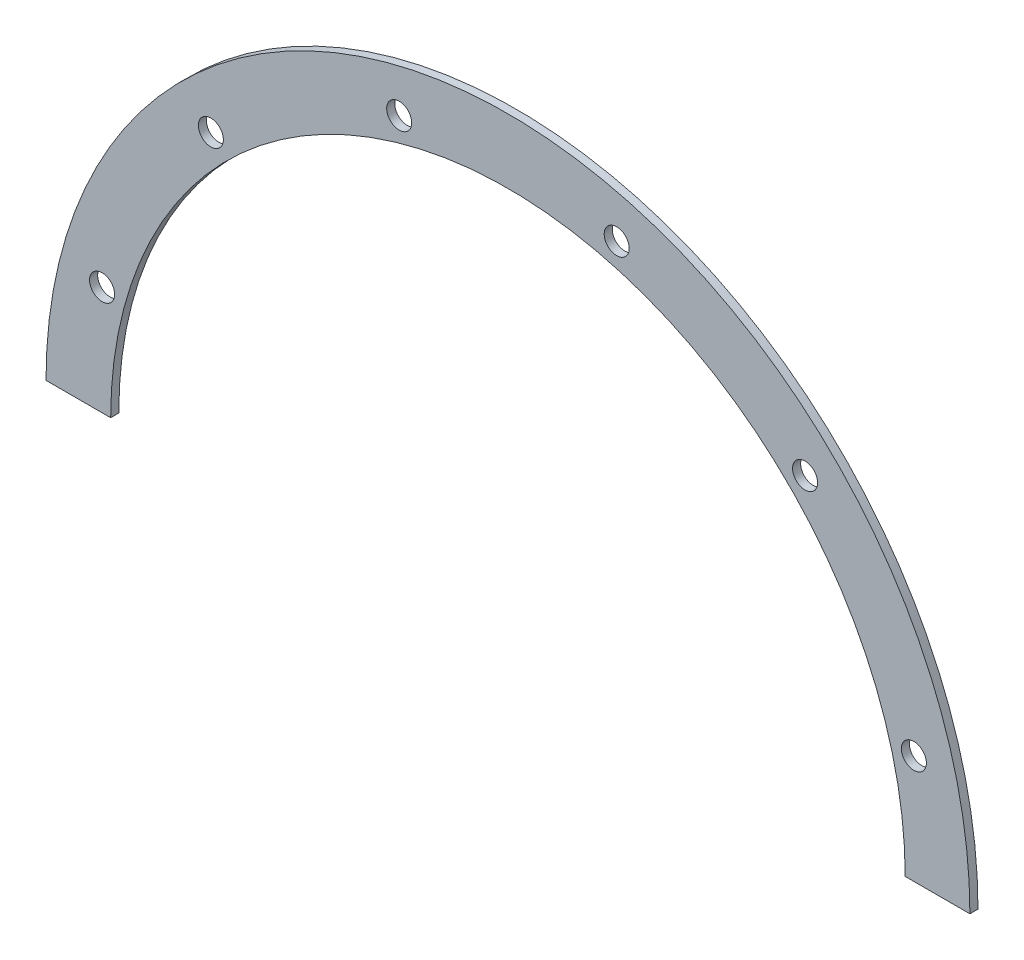
ISO-10303-21;
HEADER;
FILE_DESCRIPTION(('STEP AP214'),'2;1');
FILE_NAME('part.step','',(''),(''),'','','');
FILE_SCHEMA(('AUTOMOTIVE_DESIGN { 1 0 10303 214 1 1 1 1 }'));
ENDSEC;
DATA;
#1=APPLICATION_CONTEXT('core data for automotive mechanical design processes');
#2=APPLICATION_PROTOCOL_DEFINITION('international standard','automotive_design',2000,#1);
#3=PRODUCT_CONTEXT('',#1,'mechanical');
#4=PRODUCT('Part','Part','',(#3));
#5=PRODUCT_RELATED_PRODUCT_CATEGORY('part','',(#4));
#6=PRODUCT_DEFINITION_FORMATION('','',#4);
#7=PRODUCT_DEFINITION_CONTEXT('part definition',#1,'design');
#8=PRODUCT_DEFINITION('design','',#6,#7);
#9=PRODUCT_DEFINITION_SHAPE('','',#8);
#10=(LENGTH_UNIT() NAMED_UNIT(*) SI_UNIT(.MILLI.,.METRE.));
#11=(NAMED_UNIT(*) PLANE_ANGLE_UNIT() SI_UNIT($,.RADIAN.));
#12=(NAMED_UNIT(*) SI_UNIT($,.STERADIAN.) SOLID_ANGLE_UNIT());
#13=UNCERTAINTY_MEASURE_WITH_UNIT(LENGTH_MEASURE(1.E-05),#10,'distance_accuracy_value','');
#14=(GEOMETRIC_REPRESENTATION_CONTEXT(3) GLOBAL_UNCERTAINTY_ASSIGNED_CONTEXT((#13)) GLOBAL_UNIT_ASSIGNED_CONTEXT((#10,
#11,#12)) REPRESENTATION_CONTEXT('',''));
#15=CARTESIAN_POINT('',(0.,0.,0.));
#16=DIRECTION('',(0.,0.,1.));
#17=DIRECTION('',(1.,0.,0.));
#18=AXIS2_PLACEMENT_3D('',#15,#16,#17);
#19=CARTESIAN_POINT('',(0.,0.,1.5875));
#20=DIRECTION('',(0.,0.,-1.));
#21=DIRECTION('',(-1.,0.,0.));
#22=AXIS2_PLACEMENT_3D('',#19,#20,#21);
#23=PLANE('',#22);
#24=CARTESIAN_POINT('',(-58.3363094478905,58.3363094478899,1.5875));
#25=DIRECTION('',(0.,0.,1.));
#26=DIRECTION('',(1.,0.,0.));
#27=AXIS2_PLACEMENT_3D('',#24,#25,#26);
#28=CIRCLE('',#27,2.45744999999999);
#29=CARTESIAN_POINT('',(-55.8788594478905,58.3363094478899,1.5875));
#30=VERTEX_POINT('',#29);
#31=EDGE_CURVE('E140',#30,#30,#28,.T.);
#32=ORIENTED_EDGE('',*,*,#31,.F.);
#33=EDGE_LOOP('',(#32));
#34=FACE_BOUND('',#33,.T.);
#35=CARTESIAN_POINT('',(21.3525712209577,79.6888806688482,1.5875));
#36=DIRECTION('',(0.,0.,1.));
#37=DIRECTION('',(1.,0.,0.));
#38=AXIS2_PLACEMENT_3D('',#35,#36,#37);
#39=CIRCLE('',#38,2.45744999999999);
#40=CARTESIAN_POINT('',(23.8100212209577,79.6888806688482,1.5875));
#41=VERTEX_POINT('',#40);
#42=EDGE_CURVE('E128',#41,#41,#39,.T.);
#43=ORIENTED_EDGE('',*,*,#42,.F.);
#44=EDGE_LOOP('',(#43));
#45=FACE_BOUND('',#44,.T.);
#46=CARTESIAN_POINT('',(58.3363094478901,58.3363094478903,1.5875));
#47=DIRECTION('',(0.,0.,1.));
#48=DIRECTION('',(1.,0.,0.));
#49=AXIS2_PLACEMENT_3D('',#46,#47,#48);
#50=CIRCLE('',#49,2.45744999999999);
#51=CARTESIAN_POINT('',(60.79375944789,58.3363094478903,1.5875));
#52=VERTEX_POINT('',#51);
#53=EDGE_CURVE('E122',#52,#52,#50,.T.);
#54=ORIENTED_EDGE('',*,*,#53,.F.);
#55=EDGE_LOOP('',(#54));
#56=FACE_BOUND('',#55,.T.);
#57=CARTESIAN_POINT('',(79.6888806688481,21.352571220958,1.5875));
#58=DIRECTION('',(0.,0.,1.));
#59=DIRECTION('',(1.,0.,0.));
#60=AXIS2_PLACEMENT_3D('',#57,#58,#59);
#61=CIRCLE('',#60,2.45744999999999);
#62=CARTESIAN_POINT('',(82.1463306688481,21.352571220958,1.5875));
#63=VERTEX_POINT('',#62);
#64=EDGE_CURVE('E116',#63,#63,#61,.T.);
#65=ORIENTED_EDGE('',*,*,#64,.F.);
#66=EDGE_LOOP('',(#65));
#67=FACE_BOUND('',#66,.T.);
#68=CARTESIAN_POINT('',(0.,0.,1.5875));
#69=DIRECTION('',(0.,0.,-1.));
#70=DIRECTION('',(-1.,0.,0.));
#71=AXIS2_PLACEMENT_3D('',#68,#69,#70);
#72=CIRCLE('',#71,78.);
#73=CARTESIAN_POINT('',(-78.,0.,1.5875));
#74=VERTEX_POINT('',#73);
#75=CARTESIAN_POINT('',(78.,0.,1.5875));
#76=VERTEX_POINT('',#75);
#77=EDGE_CURVE('E87',#74,#76,#72,.T.);
#78=ORIENTED_EDGE('',*,*,#77,.T.);
#79=DIRECTION('',(1.,0.,0.));
#80=VECTOR('',#79,1.);
#81=CARTESIAN_POINT('',(78.,0.,1.5875));
#82=LINE('',#81,#80);
#83=CARTESIAN_POINT('',(90.7,0.,1.5875));
#84=VERTEX_POINT('',#83);
#85=EDGE_CURVE('E82',#76,#84,#82,.T.);
#86=ORIENTED_EDGE('',*,*,#85,.T.);
#87=CARTESIAN_POINT('',(0.,0.,1.5875));
#88=DIRECTION('',(0.,0.,1.));
#89=DIRECTION('',(1.,0.,0.));
#90=AXIS2_PLACEMENT_3D('',#87,#88,#89);
#91=CIRCLE('',#90,90.7);
#92=CARTESIAN_POINT('',(-90.7,0.,1.5875));
#93=VERTEX_POINT('',#92);
#94=EDGE_CURVE('E85',#84,#93,#91,.T.);
#95=ORIENTED_EDGE('',*,*,#94,.T.);
#96=DIRECTION('',(1.,0.,0.));
#97=VECTOR('',#96,1.);
#98=CARTESIAN_POINT('',(-90.7,0.,1.5875));
#99=LINE('',#98,#97);
#100=EDGE_CURVE('E52',#93,#74,#99,.T.);
#101=ORIENTED_EDGE('',*,*,#100,.T.);
#102=EDGE_LOOP('',(#78,#86,#95,#101));
#103=FACE_BOUND('',#102,.T.);
#104=CARTESIAN_POINT('',(-21.3525712209583,79.6888806688481,1.5875));
#105=DIRECTION('',(0.,0.,1.));
#106=DIRECTION('',(1.,0.,0.));
#107=AXIS2_PLACEMENT_3D('',#104,#105,#106);
#108=CIRCLE('',#107,2.45744999999999);
#109=CARTESIAN_POINT('',(-18.8951212209583,79.6888806688481,1.5875));
#110=VERTEX_POINT('',#109);
#111=EDGE_CURVE('E134',#110,#110,#108,.T.);
#112=ORIENTED_EDGE('',*,*,#111,.F.);
#113=EDGE_LOOP('',(#112));
#114=FACE_BOUND('',#113,.T.);
#115=CARTESIAN_POINT('',(-79.6888806688483,21.3525712209574,1.5875));
#116=DIRECTION('',(0.,0.,1.));
#117=DIRECTION('',(1.,0.,0.));
#118=AXIS2_PLACEMENT_3D('',#115,#116,#117);
#119=CIRCLE('',#118,2.45744999999999);
#120=CARTESIAN_POINT('',(-77.2314306688483,21.3525712209574,1.5875));
#121=VERTEX_POINT('',#120);
#122=EDGE_CURVE('E146',#121,#121,#119,.T.);
#123=ORIENTED_EDGE('',*,*,#122,.F.);
#124=EDGE_LOOP('',(#123));
#125=FACE_BOUND('',#124,.T.);
#126=ADVANCED_FACE('F35',(#34,#45,#56,#67,#103,#114,#125),#23,.F.);
#127=CARTESIAN_POINT('',(0.,0.,0.));
#128=DIRECTION('',(0.,0.,-1.));
#129=DIRECTION('',(-1.,0.,0.));
#130=AXIS2_PLACEMENT_3D('',#127,#128,#129);
#131=PLANE('',#130);
#132=CARTESIAN_POINT('',(-58.3363094478905,58.3363094478899,0.));
#133=DIRECTION('',(0.,0.,1.));
#134=DIRECTION('',(1.,0.,0.));
#135=AXIS2_PLACEMENT_3D('',#132,#133,#134);
#136=CIRCLE('',#135,2.45745);
#137=CARTESIAN_POINT('',(-55.8788594478905,58.3363094478899,0.));
#138=VERTEX_POINT('',#137);
#139=EDGE_CURVE('E137',#138,#138,#136,.T.);
#140=ORIENTED_EDGE('',*,*,#139,.T.);
#141=EDGE_LOOP('',(#140));
#142=FACE_BOUND('',#141,.T.);
#143=CARTESIAN_POINT('',(21.3525712209577,79.6888806688482,0.));
#144=DIRECTION('',(0.,0.,1.));
#145=DIRECTION('',(1.,0.,0.));
#146=AXIS2_PLACEMENT_3D('',#143,#144,#145);
#147=CIRCLE('',#146,2.45745);
#148=CARTESIAN_POINT('',(23.8100212209577,79.6888806688482,0.));
#149=VERTEX_POINT('',#148);
#150=EDGE_CURVE('E125',#149,#149,#147,.T.);
#151=ORIENTED_EDGE('',*,*,#150,.T.);
#152=EDGE_LOOP('',(#151));
#153=FACE_BOUND('',#152,.T.);
#154=CARTESIAN_POINT('',(0.,0.,0.));
#155=DIRECTION('',(0.,0.,-1.));
#156=DIRECTION('',(-1.,0.,0.));
#157=AXIS2_PLACEMENT_3D('',#154,#155,#156);
#158=CIRCLE('',#157,78.);
#159=CARTESIAN_POINT('',(-78.,0.,0.));
#160=VERTEX_POINT('',#159);
#161=CARTESIAN_POINT('',(78.,0.,0.));
#162=VERTEX_POINT('',#161);
#163=EDGE_CURVE('E99',#160,#162,#158,.T.);
#164=ORIENTED_EDGE('',*,*,#163,.F.);
#165=DIRECTION('',(1.,0.,0.));
#166=VECTOR('',#165,1.);
#167=CARTESIAN_POINT('',(-90.7,0.,0.));
#168=LINE('',#167,#166);
#169=CARTESIAN_POINT('',(-90.7,0.,0.));
#170=VERTEX_POINT('',#169);
#171=EDGE_CURVE('E75',#170,#160,#168,.T.);
#172=ORIENTED_EDGE('',*,*,#171,.F.);
#173=CARTESIAN_POINT('',(0.,0.,0.));
#174=DIRECTION('',(0.,0.,1.));
#175=DIRECTION('',(1.,0.,0.));
#176=AXIS2_PLACEMENT_3D('',#173,#174,#175);
#177=CIRCLE('',#176,90.7);
#178=CARTESIAN_POINT('',(90.7,0.,0.));
#179=VERTEX_POINT('',#178);
#180=EDGE_CURVE('E69',#179,#170,#177,.T.);
#181=ORIENTED_EDGE('',*,*,#180,.F.);
#182=DIRECTION('',(1.,0.,0.));
#183=VECTOR('',#182,1.);
#184=CARTESIAN_POINT('',(78.,0.,0.));
#185=LINE('',#184,#183);
#186=EDGE_CURVE('E91',#162,#179,#185,.T.);
#187=ORIENTED_EDGE('',*,*,#186,.F.);
#188=EDGE_LOOP('',(#164,#172,#181,#187));
#189=FACE_BOUND('',#188,.T.);
#190=CARTESIAN_POINT('',(79.6888806688481,21.352571220958,0.));
#191=DIRECTION('',(0.,0.,1.));
#192=DIRECTION('',(1.,0.,0.));
#193=AXIS2_PLACEMENT_3D('',#190,#191,#192);
#194=CIRCLE('',#193,2.45745);
#195=CARTESIAN_POINT('',(82.1463306688481,21.352571220958,0.));
#196=VERTEX_POINT('',#195);
#197=EDGE_CURVE('E102',#196,#196,#194,.T.);
#198=ORIENTED_EDGE('',*,*,#197,.T.);
#199=EDGE_LOOP('',(#198));
#200=FACE_BOUND('',#199,.T.);
#201=CARTESIAN_POINT('',(58.3363094478901,58.3363094478903,0.));
#202=DIRECTION('',(0.,0.,1.));
#203=DIRECTION('',(1.,0.,0.));
#204=AXIS2_PLACEMENT_3D('',#201,#202,#203);
#205=CIRCLE('',#204,2.45745);
#206=CARTESIAN_POINT('',(60.7937594478901,58.3363094478903,0.));
#207=VERTEX_POINT('',#206);
#208=EDGE_CURVE('E119',#207,#207,#205,.T.);
#209=ORIENTED_EDGE('',*,*,#208,.T.);
#210=EDGE_LOOP('',(#209));
#211=FACE_BOUND('',#210,.T.);
#212=CARTESIAN_POINT('',(-21.3525712209583,79.6888806688481,0.));
#213=DIRECTION('',(0.,0.,1.));
#214=DIRECTION('',(1.,0.,0.));
#215=AXIS2_PLACEMENT_3D('',#212,#213,#214);
#216=CIRCLE('',#215,2.45745);
#217=CARTESIAN_POINT('',(-18.8951212209583,79.6888806688481,0.));
#218=VERTEX_POINT('',#217);
#219=EDGE_CURVE('E131',#218,#218,#216,.T.);
#220=ORIENTED_EDGE('',*,*,#219,.T.);
#221=EDGE_LOOP('',(#220));
#222=FACE_BOUND('',#221,.T.);
#223=CARTESIAN_POINT('',(-79.6888806688483,21.3525712209574,0.));
#224=DIRECTION('',(0.,0.,1.));
#225=DIRECTION('',(1.,0.,0.));
#226=AXIS2_PLACEMENT_3D('',#223,#224,#225);
#227=CIRCLE('',#226,2.45745);
#228=CARTESIAN_POINT('',(-77.2314306688483,21.3525712209574,0.));
#229=VERTEX_POINT('',#228);
#230=EDGE_CURVE('E143',#229,#229,#227,.T.);
#231=ORIENTED_EDGE('',*,*,#230,.T.);
#232=EDGE_LOOP('',(#231));
#233=FACE_BOUND('',#232,.T.);
#234=ADVANCED_FACE('F110',(#142,#153,#189,#200,#211,#222,#233),#131,.T.);
#235=CARTESIAN_POINT('',(0.,0.,1.5875));
#236=DIRECTION('',(0.,0.,-1.));
#237=DIRECTION('',(-1.,0.,0.));
#238=AXIS2_PLACEMENT_3D('',#235,#236,#237);
#239=CYLINDRICAL_SURFACE('',#238,78.);
#240=ORIENTED_EDGE('',*,*,#163,.T.);
#241=DIRECTION('',(0.,0.,-1.));
#242=VECTOR('',#241,1.);
#243=CARTESIAN_POINT('',(78.,0.,1.5875));
#244=LINE('',#243,#242);
#245=EDGE_CURVE('E11',#76,#162,#244,.T.);
#246=ORIENTED_EDGE('',*,*,#245,.F.);
#247=ORIENTED_EDGE('',*,*,#77,.F.);
#248=DIRECTION('',(0.,0.,-1.));
#249=VECTOR('',#248,1.);
#250=CARTESIAN_POINT('',(-78.,0.,1.5875));
#251=LINE('',#250,#249);
#252=EDGE_CURVE('E95',#74,#160,#251,.T.);
#253=ORIENTED_EDGE('',*,*,#252,.T.);
#254=EDGE_LOOP('',(#240,#246,#247,#253));
#255=FACE_BOUND('',#254,.T.);
#256=ADVANCED_FACE('F37',(#255),#239,.F.);
#257=CARTESIAN_POINT('',(78.,0.,1.5875));
#258=DIRECTION('',(0.,1.,0.));
#259=DIRECTION('',(0.,0.,1.));
#260=AXIS2_PLACEMENT_3D('',#257,#258,#259);
#261=PLANE('',#260);
#262=ORIENTED_EDGE('',*,*,#186,.T.);
#263=DIRECTION('',(0.,0.,-1.));
#264=VECTOR('',#263,1.);
#265=CARTESIAN_POINT('',(90.7,0.,1.5875));
#266=LINE('',#265,#264);
#267=EDGE_CURVE('E44',#84,#179,#266,.T.);
#268=ORIENTED_EDGE('',*,*,#267,.F.);
#269=ORIENTED_EDGE('',*,*,#85,.F.);
#270=ORIENTED_EDGE('',*,*,#245,.T.);
#271=EDGE_LOOP('',(#262,#268,#269,#270));
#272=FACE_BOUND('',#271,.T.);
#273=ADVANCED_FACE('F90',(#272),#261,.F.);
#274=CARTESIAN_POINT('',(0.,0.,1.5875));
#275=DIRECTION('',(0.,0.,-1.));
#276=DIRECTION('',(-1.,0.,0.));
#277=AXIS2_PLACEMENT_3D('',#274,#275,#276);
#278=CYLINDRICAL_SURFACE('',#277,90.7);
#279=ORIENTED_EDGE('',*,*,#180,.T.);
#280=DIRECTION('',(0.,0.,-1.));
#281=VECTOR('',#280,1.);
#282=CARTESIAN_POINT('',(-90.7,0.,1.5875));
#283=LINE('',#282,#281);
#284=EDGE_CURVE('E92',#93,#170,#283,.T.);
#285=ORIENTED_EDGE('',*,*,#284,.F.);
#286=ORIENTED_EDGE('',*,*,#94,.F.);
#287=ORIENTED_EDGE('',*,*,#267,.T.);
#288=EDGE_LOOP('',(#279,#285,#286,#287));
#289=FACE_BOUND('',#288,.T.);
#290=ADVANCED_FACE('F93',(#289),#278,.T.);
#291=CARTESIAN_POINT('',(-90.7,0.,1.5875));
#292=DIRECTION('',(0.,1.,0.));
#293=DIRECTION('',(0.,0.,1.));
#294=AXIS2_PLACEMENT_3D('',#291,#292,#293);
#295=PLANE('',#294);
#296=ORIENTED_EDGE('',*,*,#171,.T.);
#297=ORIENTED_EDGE('',*,*,#252,.F.);
#298=ORIENTED_EDGE('',*,*,#100,.F.);
#299=ORIENTED_EDGE('',*,*,#284,.T.);
#300=EDGE_LOOP('',(#296,#297,#298,#299));
#301=FACE_BOUND('',#300,.T.);
#302=ADVANCED_FACE('F107',(#301),#295,.F.);
#303=CARTESIAN_POINT('',(79.6888806688481,21.352571220958,1.5875));
#304=DIRECTION('',(0.,0.,1.));
#305=DIRECTION('',(1.,0.,0.));
#306=AXIS2_PLACEMENT_3D('',#303,#304,#305);
#307=CYLINDRICAL_SURFACE('',#306,2.45744999999999);
#308=ORIENTED_EDGE('',*,*,#197,.F.);
#309=EDGE_LOOP('',(#308));
#310=FACE_BOUND('',#309,.T.);
#311=ORIENTED_EDGE('',*,*,#64,.T.);
#312=EDGE_LOOP('',(#311));
#313=FACE_BOUND('',#312,.T.);
#314=ADVANCED_FACE('F163',(#310,#313),#307,.F.);
#315=CARTESIAN_POINT('',(58.3363094478901,58.3363094478903,1.5875));
#316=DIRECTION('',(0.,0.,1.));
#317=DIRECTION('',(1.,0.,0.));
#318=AXIS2_PLACEMENT_3D('',#315,#316,#317);
#319=CYLINDRICAL_SURFACE('',#318,2.45744999999999);
#320=ORIENTED_EDGE('',*,*,#208,.F.);
#321=EDGE_LOOP('',(#320));
#322=FACE_BOUND('',#321,.T.);
#323=ORIENTED_EDGE('',*,*,#53,.T.);
#324=EDGE_LOOP('',(#323));
#325=FACE_BOUND('',#324,.T.);
#326=ADVANCED_FACE('F188',(#322,#325),#319,.F.);
#327=CARTESIAN_POINT('',(21.3525712209577,79.6888806688482,1.5875));
#328=DIRECTION('',(0.,0.,1.));
#329=DIRECTION('',(1.,0.,0.));
#330=AXIS2_PLACEMENT_3D('',#327,#328,#329);
#331=CYLINDRICAL_SURFACE('',#330,2.45744999999999);
#332=ORIENTED_EDGE('',*,*,#150,.F.);
#333=EDGE_LOOP('',(#332));
#334=FACE_BOUND('',#333,.T.);
#335=ORIENTED_EDGE('',*,*,#42,.T.);
#336=EDGE_LOOP('',(#335));
#337=FACE_BOUND('',#336,.T.);
#338=ADVANCED_FACE('F193',(#334,#337),#331,.F.);
#339=CARTESIAN_POINT('',(-21.3525712209583,79.6888806688481,1.5875));
#340=DIRECTION('',(0.,0.,1.));
#341=DIRECTION('',(1.,0.,0.));
#342=AXIS2_PLACEMENT_3D('',#339,#340,#341);
#343=CYLINDRICAL_SURFACE('',#342,2.45744999999999);
#344=ORIENTED_EDGE('',*,*,#219,.F.);
#345=EDGE_LOOP('',(#344));
#346=FACE_BOUND('',#345,.T.);
#347=ORIENTED_EDGE('',*,*,#111,.T.);
#348=EDGE_LOOP('',(#347));
#349=FACE_BOUND('',#348,.T.);
#350=ADVANCED_FACE('F203',(#346,#349),#343,.F.);
#351=CARTESIAN_POINT('',(-58.3363094478905,58.3363094478899,1.5875));
#352=DIRECTION('',(0.,0.,1.));
#353=DIRECTION('',(1.,0.,0.));
#354=AXIS2_PLACEMENT_3D('',#351,#352,#353);
#355=CYLINDRICAL_SURFACE('',#354,2.45744999999999);
#356=ORIENTED_EDGE('',*,*,#139,.F.);
#357=EDGE_LOOP('',(#356));
#358=FACE_BOUND('',#357,.T.);
#359=ORIENTED_EDGE('',*,*,#31,.T.);
#360=EDGE_LOOP('',(#359));
#361=FACE_BOUND('',#360,.T.);
#362=ADVANCED_FACE('F213',(#358,#361),#355,.F.);
#363=CARTESIAN_POINT('',(-79.6888806688483,21.3525712209574,1.5875));
#364=DIRECTION('',(0.,0.,1.));
#365=DIRECTION('',(1.,0.,0.));
#366=AXIS2_PLACEMENT_3D('',#363,#364,#365);
#367=CYLINDRICAL_SURFACE('',#366,2.45744999999999);
#368=ORIENTED_EDGE('',*,*,#230,.F.);
#369=EDGE_LOOP('',(#368));
#370=FACE_BOUND('',#369,.T.);
#371=ORIENTED_EDGE('',*,*,#122,.T.);
#372=EDGE_LOOP('',(#371));
#373=FACE_BOUND('',#372,.T.);
#374=ADVANCED_FACE('F150',(#370,#373),#367,.F.);
#375=CLOSED_SHELL('',(#126,#234,#256,#273,#290,#302,#314,#326,#338,#350,#362,#374));
#376=MANIFOLD_SOLID_BREP('B2',#375);
#377=ADVANCED_BREP_SHAPE_REPRESENTATION('',(#18,#376),#14);
#378=SHAPE_DEFINITION_REPRESENTATION(#9,#377);
ENDSEC;
END-ISO-10303-21;
